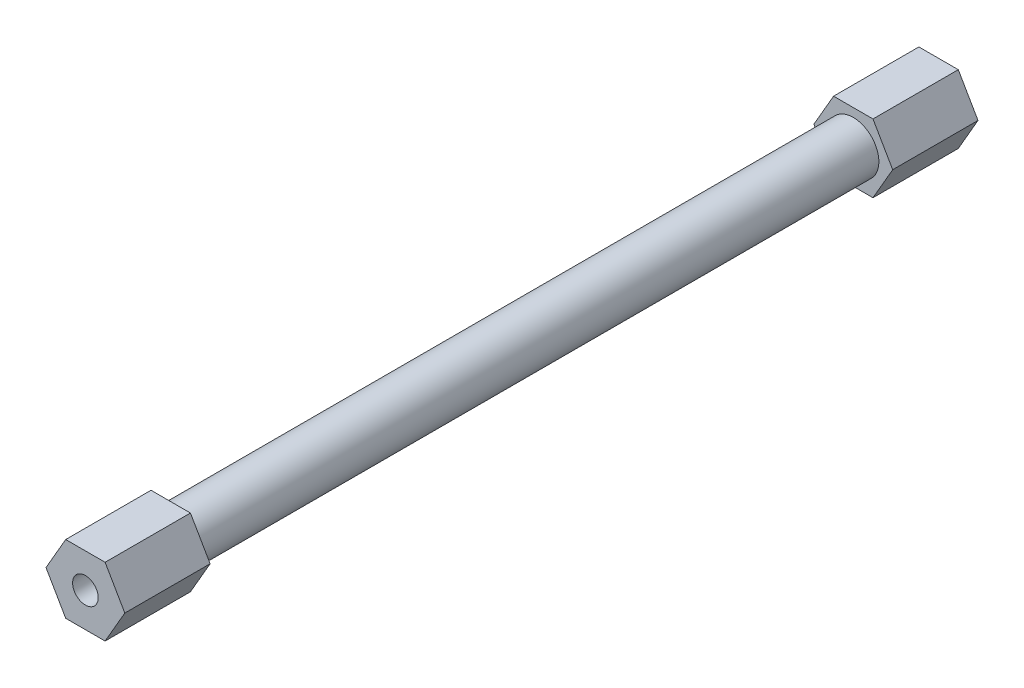
ISO-10303-21;
HEADER;
FILE_DESCRIPTION(('STEP AP214'),'2;1');
FILE_NAME('part.step','',(''),(''),'','','');
FILE_SCHEMA(('AUTOMOTIVE_DESIGN { 1 0 10303 214 1 1 1 1 }'));
ENDSEC;
DATA;
#1=APPLICATION_CONTEXT('core data for automotive mechanical design processes');
#2=APPLICATION_PROTOCOL_DEFINITION('international standard','automotive_design',2000,#1);
#3=PRODUCT_CONTEXT('',#1,'mechanical');
#4=PRODUCT('Part','Part','',(#3));
#5=PRODUCT_RELATED_PRODUCT_CATEGORY('part','',(#4));
#6=PRODUCT_DEFINITION_FORMATION('','',#4);
#7=PRODUCT_DEFINITION_CONTEXT('part definition',#1,'design');
#8=PRODUCT_DEFINITION('design','',#6,#7);
#9=PRODUCT_DEFINITION_SHAPE('','',#8);
#10=(LENGTH_UNIT() NAMED_UNIT(*) SI_UNIT(.MILLI.,.METRE.));
#11=(NAMED_UNIT(*) PLANE_ANGLE_UNIT() SI_UNIT($,.RADIAN.));
#12=(NAMED_UNIT(*) SI_UNIT($,.STERADIAN.) SOLID_ANGLE_UNIT());
#13=UNCERTAINTY_MEASURE_WITH_UNIT(LENGTH_MEASURE(1.E-05),#10,'distance_accuracy_value','');
#14=(GEOMETRIC_REPRESENTATION_CONTEXT(3) GLOBAL_UNCERTAINTY_ASSIGNED_CONTEXT((#13)) GLOBAL_UNIT_ASSIGNED_CONTEXT((#10,
#11,#12)) REPRESENTATION_CONTEXT('',''));
#15=CARTESIAN_POINT('',(0.,0.,0.));
#16=DIRECTION('',(0.,0.,1.));
#17=DIRECTION('',(1.,0.,0.));
#18=AXIS2_PLACEMENT_3D('',#15,#16,#17);
#19=CARTESIAN_POINT('',(0.,0.,100.));
#20=DIRECTION('',(0.,0.,-1.));
#21=DIRECTION('',(-1.,0.,0.));
#22=AXIS2_PLACEMENT_3D('',#19,#20,#21);
#23=CYLINDRICAL_SURFACE('',#22,3.);
#24=CARTESIAN_POINT('',(0.,0.,90.));
#25=DIRECTION('',(0.,0.,1.));
#26=DIRECTION('',(1.,0.,0.));
#27=AXIS2_PLACEMENT_3D('',#24,#25,#26);
#28=CIRCLE('',#27,3.);
#29=CARTESIAN_POINT('',(3.,0.,90.));
#30=VERTEX_POINT('',#29);
#31=EDGE_CURVE('E41',#30,#30,#28,.T.);
#32=ORIENTED_EDGE('',*,*,#31,.F.);
#33=EDGE_LOOP('',(#32));
#34=FACE_BOUND('',#33,.T.);
#35=CARTESIAN_POINT('',(0.,0.,9.99999999999999));
#36=DIRECTION('',(0.,0.,-1.));
#37=DIRECTION('',(-1.,0.,0.));
#38=AXIS2_PLACEMENT_3D('',#35,#36,#37);
#39=CIRCLE('',#38,3.);
#40=CARTESIAN_POINT('',(-3.,0.,9.99999999999999));
#41=VERTEX_POINT('',#40);
#42=EDGE_CURVE('E11',#41,#41,#39,.T.);
#43=ORIENTED_EDGE('',*,*,#42,.F.);
#44=EDGE_LOOP('',(#43));
#45=FACE_BOUND('',#44,.T.);
#46=ADVANCED_FACE('F32',(#34,#45),#23,.T.);
#47=CARTESIAN_POINT('',(0.,0.,100.));
#48=DIRECTION('',(0.,0.,1.));
#49=DIRECTION('',(1.,0.,0.));
#50=AXIS2_PLACEMENT_3D('',#47,#48,#49);
#51=PLANE('',#50);
#52=CARTESIAN_POINT('',(0.,0.,100.));
#53=DIRECTION('',(0.,0.,1.));
#54=DIRECTION('',(1.,0.,0.));
#55=AXIS2_PLACEMENT_3D('',#52,#53,#54);
#56=CIRCLE('',#55,1.5);
#57=CARTESIAN_POINT('',(1.5,0.,100.));
#58=VERTEX_POINT('',#57);
#59=EDGE_CURVE('E150',#58,#58,#56,.T.);
#60=ORIENTED_EDGE('',*,*,#59,.F.);
#61=EDGE_LOOP('',(#60));
#62=FACE_BOUND('',#61,.T.);
#63=DIRECTION('',(0.5,0.866025403784439,0.));
#64=VECTOR('',#63,1.);
#65=CARTESIAN_POINT('',(2.3094010767585,-4.,100.));
#66=LINE('',#65,#64);
#67=CARTESIAN_POINT('',(2.3094010767585,-4.,100.));
#68=VERTEX_POINT('',#67);
#69=CARTESIAN_POINT('',(4.61880215351701,0.,100.));
#70=VERTEX_POINT('',#69);
#71=EDGE_CURVE('E126',#68,#70,#66,.T.);
#72=ORIENTED_EDGE('',*,*,#71,.T.);
#73=DIRECTION('',(-0.5,0.866025403784438,0.));
#74=VECTOR('',#73,1.);
#75=CARTESIAN_POINT('',(4.61880215351701,0.,100.));
#76=LINE('',#75,#74);
#77=CARTESIAN_POINT('',(2.3094010767585,4.,100.));
#78=VERTEX_POINT('',#77);
#79=EDGE_CURVE('E129',#70,#78,#76,.T.);
#80=ORIENTED_EDGE('',*,*,#79,.T.);
#81=DIRECTION('',(-1.,0.,0.));
#82=VECTOR('',#81,1.);
#83=CARTESIAN_POINT('',(2.3094010767585,4.,100.));
#84=LINE('',#83,#82);
#85=CARTESIAN_POINT('',(-2.3094010767585,4.,100.));
#86=VERTEX_POINT('',#85);
#87=EDGE_CURVE('E133',#78,#86,#84,.T.);
#88=ORIENTED_EDGE('',*,*,#87,.T.);
#89=DIRECTION('',(-0.5,-0.866025403784439,0.));
#90=VECTOR('',#89,1.);
#91=CARTESIAN_POINT('',(-2.3094010767585,4.,100.));
#92=LINE('',#91,#90);
#93=CARTESIAN_POINT('',(-4.61880215351701,0.,100.));
#94=VERTEX_POINT('',#93);
#95=EDGE_CURVE('E136',#86,#94,#92,.T.);
#96=ORIENTED_EDGE('',*,*,#95,.T.);
#97=DIRECTION('',(0.5,-0.866025403784439,0.));
#98=VECTOR('',#97,1.);
#99=CARTESIAN_POINT('',(-4.61880215351701,0.,100.));
#100=LINE('',#99,#98);
#101=CARTESIAN_POINT('',(-2.3094010767585,-4.,100.));
#102=VERTEX_POINT('',#101);
#103=EDGE_CURVE('E102',#94,#102,#100,.T.);
#104=ORIENTED_EDGE('',*,*,#103,.T.);
#105=DIRECTION('',(1.,0.,0.));
#106=VECTOR('',#105,1.);
#107=CARTESIAN_POINT('',(-2.3094010767585,-4.,100.));
#108=LINE('',#107,#106);
#109=EDGE_CURVE('E139',#102,#68,#108,.T.);
#110=ORIENTED_EDGE('',*,*,#109,.T.);
#111=EDGE_LOOP('',(#72,#80,#88,#96,#104,#110));
#112=FACE_BOUND('',#111,.T.);
#113=ADVANCED_FACE('F169',(#62,#112),#51,.T.);
#114=CARTESIAN_POINT('',(0.,0.,0.));
#115=DIRECTION('',(0.,0.,1.));
#116=DIRECTION('',(1.,0.,0.));
#117=AXIS2_PLACEMENT_3D('',#114,#115,#116);
#118=PLANE('',#117);
#119=CARTESIAN_POINT('',(0.,0.,0.));
#120=DIRECTION('',(0.,0.,1.));
#121=DIRECTION('',(1.,0.,0.));
#122=AXIS2_PLACEMENT_3D('',#119,#120,#121);
#123=CIRCLE('',#122,1.5);
#124=CARTESIAN_POINT('',(1.5,0.,0.));
#125=VERTEX_POINT('',#124);
#126=EDGE_CURVE('E35',#125,#125,#123,.T.);
#127=ORIENTED_EDGE('',*,*,#126,.T.);
#128=EDGE_LOOP('',(#127));
#129=FACE_BOUND('',#128,.T.);
#130=DIRECTION('',(0.5,0.866025403784439,0.));
#131=VECTOR('',#130,1.);
#132=CARTESIAN_POINT('',(2.3094010767585,-4.,0.));
#133=LINE('',#132,#131);
#134=CARTESIAN_POINT('',(2.3094010767585,-4.,0.));
#135=VERTEX_POINT('',#134);
#136=CARTESIAN_POINT('',(4.61880215351701,0.,0.));
#137=VERTEX_POINT('',#136);
#138=EDGE_CURVE('E268',#135,#137,#133,.T.);
#139=ORIENTED_EDGE('',*,*,#138,.F.);
#140=DIRECTION('',(1.,0.,0.));
#141=VECTOR('',#140,1.);
#142=CARTESIAN_POINT('',(-2.3094010767585,-4.,0.));
#143=LINE('',#142,#141);
#144=CARTESIAN_POINT('',(-2.3094010767585,-4.,0.));
#145=VERTEX_POINT('',#144);
#146=EDGE_CURVE('E265',#145,#135,#143,.T.);
#147=ORIENTED_EDGE('',*,*,#146,.F.);
#148=DIRECTION('',(0.5,-0.866025403784439,0.));
#149=VECTOR('',#148,1.);
#150=CARTESIAN_POINT('',(-4.61880215351701,0.,0.));
#151=LINE('',#150,#149);
#152=CARTESIAN_POINT('',(-4.61880215351701,0.,0.));
#153=VERTEX_POINT('',#152);
#154=EDGE_CURVE('E262',#153,#145,#151,.T.);
#155=ORIENTED_EDGE('',*,*,#154,.F.);
#156=DIRECTION('',(-0.5,-0.866025403784439,0.));
#157=VECTOR('',#156,1.);
#158=CARTESIAN_POINT('',(-2.3094010767585,4.,0.));
#159=LINE('',#158,#157);
#160=CARTESIAN_POINT('',(-2.3094010767585,4.,0.));
#161=VERTEX_POINT('',#160);
#162=EDGE_CURVE('E259',#161,#153,#159,.T.);
#163=ORIENTED_EDGE('',*,*,#162,.F.);
#164=DIRECTION('',(-1.,0.,0.));
#165=VECTOR('',#164,1.);
#166=CARTESIAN_POINT('',(2.3094010767585,4.,0.));
#167=LINE('',#166,#165);
#168=CARTESIAN_POINT('',(2.3094010767585,4.,0.));
#169=VERTEX_POINT('',#168);
#170=EDGE_CURVE('E256',#169,#161,#167,.T.);
#171=ORIENTED_EDGE('',*,*,#170,.F.);
#172=DIRECTION('',(-0.5,0.866025403784438,0.));
#173=VECTOR('',#172,1.);
#174=CARTESIAN_POINT('',(4.61880215351701,0.,0.));
#175=LINE('',#174,#173);
#176=EDGE_CURVE('E252',#137,#169,#175,.T.);
#177=ORIENTED_EDGE('',*,*,#176,.F.);
#178=EDGE_LOOP('',(#139,#147,#155,#163,#171,#177));
#179=FACE_BOUND('',#178,.T.);
#180=ADVANCED_FACE('F157',(#129,#179),#118,.F.);
#181=CARTESIAN_POINT('',(0.,0.,100.));
#182=DIRECTION('',(0.,0.,-1.));
#183=DIRECTION('',(-1.,0.,0.));
#184=AXIS2_PLACEMENT_3D('',#181,#182,#183);
#185=CYLINDRICAL_SURFACE('',#184,1.5);
#186=ORIENTED_EDGE('',*,*,#126,.F.);
#187=EDGE_LOOP('',(#186));
#188=FACE_BOUND('',#187,.T.);
#189=ORIENTED_EDGE('',*,*,#59,.T.);
#190=EDGE_LOOP('',(#189));
#191=FACE_BOUND('',#190,.T.);
#192=ADVANCED_FACE('F160',(#188,#191),#185,.F.);
#193=CARTESIAN_POINT('',(0.,0.,90.));
#194=DIRECTION('',(0.,0.,1.));
#195=DIRECTION('',(1.,0.,0.));
#196=AXIS2_PLACEMENT_3D('',#193,#194,#195);
#197=PLANE('',#196);
#198=DIRECTION('',(0.5,0.866025403784439,0.));
#199=VECTOR('',#198,1.);
#200=CARTESIAN_POINT('',(2.3094010767585,-4.,90.));
#201=LINE('',#200,#199);
#202=CARTESIAN_POINT('',(2.3094010767585,-4.,90.));
#203=VERTEX_POINT('',#202);
#204=CARTESIAN_POINT('',(4.61880215351701,0.,90.));
#205=VERTEX_POINT('',#204);
#206=EDGE_CURVE('E142',#203,#205,#201,.T.);
#207=ORIENTED_EDGE('',*,*,#206,.F.);
#208=DIRECTION('',(1.,0.,0.));
#209=VECTOR('',#208,1.);
#210=CARTESIAN_POINT('',(-2.3094010767585,-4.,90.));
#211=LINE('',#210,#209);
#212=CARTESIAN_POINT('',(-2.3094010767585,-4.,90.));
#213=VERTEX_POINT('',#212);
#214=EDGE_CURVE('E116',#213,#203,#211,.T.);
#215=ORIENTED_EDGE('',*,*,#214,.F.);
#216=DIRECTION('',(0.5,-0.866025403784439,0.));
#217=VECTOR('',#216,1.);
#218=CARTESIAN_POINT('',(-4.61880215351701,0.,90.));
#219=LINE('',#218,#217);
#220=CARTESIAN_POINT('',(-4.61880215351701,0.,90.));
#221=VERTEX_POINT('',#220);
#222=EDGE_CURVE('E100',#221,#213,#219,.T.);
#223=ORIENTED_EDGE('',*,*,#222,.F.);
#224=DIRECTION('',(-0.5,-0.866025403784439,0.));
#225=VECTOR('',#224,1.);
#226=CARTESIAN_POINT('',(-2.3094010767585,4.,90.));
#227=LINE('',#226,#225);
#228=CARTESIAN_POINT('',(-2.3094010767585,4.,90.));
#229=VERTEX_POINT('',#228);
#230=EDGE_CURVE('E114',#229,#221,#227,.T.);
#231=ORIENTED_EDGE('',*,*,#230,.F.);
#232=DIRECTION('',(-1.,0.,0.));
#233=VECTOR('',#232,1.);
#234=CARTESIAN_POINT('',(2.3094010767585,4.,90.));
#235=LINE('',#234,#233);
#236=CARTESIAN_POINT('',(2.3094010767585,4.,90.));
#237=VERTEX_POINT('',#236);
#238=EDGE_CURVE('E119',#237,#229,#235,.T.);
#239=ORIENTED_EDGE('',*,*,#238,.F.);
#240=DIRECTION('',(-0.5,0.866025403784438,0.));
#241=VECTOR('',#240,1.);
#242=CARTESIAN_POINT('',(4.61880215351701,0.,90.));
#243=LINE('',#242,#241);
#244=EDGE_CURVE('E121',#205,#237,#243,.T.);
#245=ORIENTED_EDGE('',*,*,#244,.F.);
#246=EDGE_LOOP('',(#207,#215,#223,#231,#239,#245));
#247=FACE_BOUND('',#246,.T.);
#248=ORIENTED_EDGE('',*,*,#31,.T.);
#249=EDGE_LOOP('',(#248));
#250=FACE_BOUND('',#249,.T.);
#251=ADVANCED_FACE('F111',(#247,#250),#197,.F.);
#252=CARTESIAN_POINT('',(2.3094010767585,-4.,90.));
#253=DIRECTION('',(0.866025403784439,-0.5,0.));
#254=DIRECTION('',(0.5,0.866025403784439,0.));
#255=AXIS2_PLACEMENT_3D('',#252,#253,#254);
#256=PLANE('',#255);
#257=ORIENTED_EDGE('',*,*,#71,.F.);
#258=DIRECTION('',(0.,0.,1.));
#259=VECTOR('',#258,1.);
#260=CARTESIAN_POINT('',(2.3094010767585,-4.,90.));
#261=LINE('',#260,#259);
#262=EDGE_CURVE('E50',#203,#68,#261,.T.);
#263=ORIENTED_EDGE('',*,*,#262,.F.);
#264=ORIENTED_EDGE('',*,*,#206,.T.);
#265=DIRECTION('',(0.,0.,1.));
#266=VECTOR('',#265,1.);
#267=CARTESIAN_POINT('',(4.61880215351701,0.,90.));
#268=LINE('',#267,#266);
#269=EDGE_CURVE('E86',#205,#70,#268,.T.);
#270=ORIENTED_EDGE('',*,*,#269,.T.);
#271=EDGE_LOOP('',(#257,#263,#264,#270));
#272=FACE_BOUND('',#271,.T.);
#273=ADVANCED_FACE('F167',(#272),#256,.T.);
#274=CARTESIAN_POINT('',(-2.3094010767585,-4.,90.));
#275=DIRECTION('',(0.,-1.,0.));
#276=DIRECTION('',(0.,0.,-1.));
#277=AXIS2_PLACEMENT_3D('',#274,#275,#276);
#278=PLANE('',#277);
#279=ORIENTED_EDGE('',*,*,#109,.F.);
#280=DIRECTION('',(0.,0.,1.));
#281=VECTOR('',#280,1.);
#282=CARTESIAN_POINT('',(-2.3094010767585,-4.,90.));
#283=LINE('',#282,#281);
#284=EDGE_CURVE('E74',#213,#102,#283,.T.);
#285=ORIENTED_EDGE('',*,*,#284,.F.);
#286=ORIENTED_EDGE('',*,*,#214,.T.);
#287=ORIENTED_EDGE('',*,*,#262,.T.);
#288=EDGE_LOOP('',(#279,#285,#286,#287));
#289=FACE_BOUND('',#288,.T.);
#290=ADVANCED_FACE('F218',(#289),#278,.T.);
#291=CARTESIAN_POINT('',(-4.61880215351701,0.,90.));
#292=DIRECTION('',(-0.866025403784439,-0.5,0.));
#293=DIRECTION('',(0.5,-0.866025403784439,0.));
#294=AXIS2_PLACEMENT_3D('',#291,#292,#293);
#295=PLANE('',#294);
#296=ORIENTED_EDGE('',*,*,#103,.F.);
#297=DIRECTION('',(0.,0.,1.));
#298=VECTOR('',#297,1.);
#299=CARTESIAN_POINT('',(-4.61880215351701,0.,90.));
#300=LINE('',#299,#298);
#301=EDGE_CURVE('E97',#221,#94,#300,.T.);
#302=ORIENTED_EDGE('',*,*,#301,.F.);
#303=ORIENTED_EDGE('',*,*,#222,.T.);
#304=ORIENTED_EDGE('',*,*,#284,.T.);
#305=EDGE_LOOP('',(#296,#302,#303,#304));
#306=FACE_BOUND('',#305,.T.);
#307=ADVANCED_FACE('F99',(#306),#295,.T.);
#308=CARTESIAN_POINT('',(-2.3094010767585,4.,90.));
#309=DIRECTION('',(-0.866025403784439,0.5,0.));
#310=DIRECTION('',(-0.5,-0.866025403784439,0.));
#311=AXIS2_PLACEMENT_3D('',#308,#309,#310);
#312=PLANE('',#311);
#313=ORIENTED_EDGE('',*,*,#95,.F.);
#314=DIRECTION('',(0.,0.,1.));
#315=VECTOR('',#314,1.);
#316=CARTESIAN_POINT('',(-2.3094010767585,4.,90.));
#317=LINE('',#316,#315);
#318=EDGE_CURVE('E107',#229,#86,#317,.T.);
#319=ORIENTED_EDGE('',*,*,#318,.F.);
#320=ORIENTED_EDGE('',*,*,#230,.T.);
#321=ORIENTED_EDGE('',*,*,#301,.T.);
#322=EDGE_LOOP('',(#313,#319,#320,#321));
#323=FACE_BOUND('',#322,.T.);
#324=ADVANCED_FACE('F118',(#323),#312,.T.);
#325=CARTESIAN_POINT('',(2.3094010767585,4.,90.));
#326=DIRECTION('',(0.,1.,0.));
#327=DIRECTION('',(-1.,0.,0.));
#328=AXIS2_PLACEMENT_3D('',#325,#326,#327);
#329=PLANE('',#328);
#330=ORIENTED_EDGE('',*,*,#87,.F.);
#331=DIRECTION('',(0.,0.,1.));
#332=VECTOR('',#331,1.);
#333=CARTESIAN_POINT('',(2.3094010767585,4.,90.));
#334=LINE('',#333,#332);
#335=EDGE_CURVE('E146',#237,#78,#334,.T.);
#336=ORIENTED_EDGE('',*,*,#335,.F.);
#337=ORIENTED_EDGE('',*,*,#238,.T.);
#338=ORIENTED_EDGE('',*,*,#318,.T.);
#339=EDGE_LOOP('',(#330,#336,#337,#338));
#340=FACE_BOUND('',#339,.T.);
#341=ADVANCED_FACE('F195',(#340),#329,.T.);
#342=CARTESIAN_POINT('',(4.61880215351701,0.,90.));
#343=DIRECTION('',(0.866025403784438,0.5,0.));
#344=DIRECTION('',(-0.5,0.866025403784438,0.));
#345=AXIS2_PLACEMENT_3D('',#342,#343,#344);
#346=PLANE('',#345);
#347=ORIENTED_EDGE('',*,*,#79,.F.);
#348=ORIENTED_EDGE('',*,*,#269,.F.);
#349=ORIENTED_EDGE('',*,*,#244,.T.);
#350=ORIENTED_EDGE('',*,*,#335,.T.);
#351=EDGE_LOOP('',(#347,#348,#349,#350));
#352=FACE_BOUND('',#351,.T.);
#353=ADVANCED_FACE('F185',(#352),#346,.T.);
#354=CARTESIAN_POINT('',(0.,0.,10.));
#355=DIRECTION('',(0.,0.,-1.));
#356=DIRECTION('',(1.,0.,0.));
#357=AXIS2_PLACEMENT_3D('',#354,#355,#356);
#358=PLANE('',#357);
#359=DIRECTION('',(0.5,0.866025403784439,0.));
#360=VECTOR('',#359,1.);
#361=CARTESIAN_POINT('',(2.3094010767585,-4.,10.));
#362=LINE('',#361,#360);
#363=CARTESIAN_POINT('',(2.3094010767585,-4.,10.));
#364=VERTEX_POINT('',#363);
#365=CARTESIAN_POINT('',(4.61880215351701,0.,10.));
#366=VERTEX_POINT('',#365);
#367=EDGE_CURVE('E255',#364,#366,#362,.T.);
#368=ORIENTED_EDGE('',*,*,#367,.T.);
#369=DIRECTION('',(-0.5,0.866025403784438,0.));
#370=VECTOR('',#369,1.);
#371=CARTESIAN_POINT('',(4.61880215351701,0.,10.));
#372=LINE('',#371,#370);
#373=CARTESIAN_POINT('',(2.3094010767585,4.,10.));
#374=VERTEX_POINT('',#373);
#375=EDGE_CURVE('E238',#366,#374,#372,.T.);
#376=ORIENTED_EDGE('',*,*,#375,.T.);
#377=DIRECTION('',(-1.,0.,0.));
#378=VECTOR('',#377,1.);
#379=CARTESIAN_POINT('',(2.3094010767585,4.,10.));
#380=LINE('',#379,#378);
#381=CARTESIAN_POINT('',(-2.3094010767585,4.,10.));
#382=VERTEX_POINT('',#381);
#383=EDGE_CURVE('E273',#374,#382,#380,.T.);
#384=ORIENTED_EDGE('',*,*,#383,.T.);
#385=DIRECTION('',(-0.5,-0.866025403784439,0.));
#386=VECTOR('',#385,1.);
#387=CARTESIAN_POINT('',(-2.3094010767585,4.,10.));
#388=LINE('',#387,#386);
#389=CARTESIAN_POINT('',(-4.61880215351701,0.,10.));
#390=VERTEX_POINT('',#389);
#391=EDGE_CURVE('E276',#382,#390,#388,.T.);
#392=ORIENTED_EDGE('',*,*,#391,.T.);
#393=DIRECTION('',(0.5,-0.866025403784439,0.));
#394=VECTOR('',#393,1.);
#395=CARTESIAN_POINT('',(-4.61880215351701,0.,10.));
#396=LINE('',#395,#394);
#397=CARTESIAN_POINT('',(-2.3094010767585,-4.,10.));
#398=VERTEX_POINT('',#397);
#399=EDGE_CURVE('E279',#390,#398,#396,.T.);
#400=ORIENTED_EDGE('',*,*,#399,.T.);
#401=DIRECTION('',(1.,0.,0.));
#402=VECTOR('',#401,1.);
#403=CARTESIAN_POINT('',(-2.3094010767585,-4.,10.));
#404=LINE('',#403,#402);
#405=EDGE_CURVE('E282',#398,#364,#404,.T.);
#406=ORIENTED_EDGE('',*,*,#405,.T.);
#407=EDGE_LOOP('',(#368,#376,#384,#392,#400,#406));
#408=FACE_BOUND('',#407,.T.);
#409=ORIENTED_EDGE('',*,*,#42,.T.);
#410=EDGE_LOOP('',(#409));
#411=FACE_BOUND('',#410,.T.);
#412=ADVANCED_FACE('F182',(#408,#411),#358,.F.);
#413=CARTESIAN_POINT('',(2.3094010767585,-4.,10.));
#414=DIRECTION('',(-0.866025403784439,0.5,0.));
#415=DIRECTION('',(-0.5,-0.866025403784439,0.));
#416=AXIS2_PLACEMENT_3D('',#413,#414,#415);
#417=PLANE('',#416);
#418=ORIENTED_EDGE('',*,*,#138,.T.);
#419=DIRECTION('',(0.,0.,-1.));
#420=VECTOR('',#419,1.);
#421=CARTESIAN_POINT('',(4.61880215351701,0.,10.));
#422=LINE('',#421,#420);
#423=EDGE_CURVE('E130',#366,#137,#422,.T.);
#424=ORIENTED_EDGE('',*,*,#423,.F.);
#425=ORIENTED_EDGE('',*,*,#367,.F.);
#426=DIRECTION('',(0.,0.,-1.));
#427=VECTOR('',#426,1.);
#428=CARTESIAN_POINT('',(2.3094010767585,-4.,10.));
#429=LINE('',#428,#427);
#430=EDGE_CURVE('E234',#364,#135,#429,.T.);
#431=ORIENTED_EDGE('',*,*,#430,.T.);
#432=EDGE_LOOP('',(#418,#424,#425,#431));
#433=FACE_BOUND('',#432,.T.);
#434=ADVANCED_FACE('F184',(#433),#417,.F.);
#435=CARTESIAN_POINT('',(4.61880215351701,0.,10.));
#436=DIRECTION('',(-0.866025403784438,-0.5,0.));
#437=DIRECTION('',(0.5,-0.866025403784438,0.));
#438=AXIS2_PLACEMENT_3D('',#435,#436,#437);
#439=PLANE('',#438);
#440=ORIENTED_EDGE('',*,*,#176,.T.);
#441=DIRECTION('',(0.,0.,-1.));
#442=VECTOR('',#441,1.);
#443=CARTESIAN_POINT('',(2.3094010767585,4.,10.));
#444=LINE('',#443,#442);
#445=EDGE_CURVE('E247',#374,#169,#444,.T.);
#446=ORIENTED_EDGE('',*,*,#445,.F.);
#447=ORIENTED_EDGE('',*,*,#375,.F.);
#448=ORIENTED_EDGE('',*,*,#423,.T.);
#449=EDGE_LOOP('',(#440,#446,#447,#448));
#450=FACE_BOUND('',#449,.T.);
#451=ADVANCED_FACE('F192',(#450),#439,.F.);
#452=CARTESIAN_POINT('',(2.3094010767585,4.,10.));
#453=DIRECTION('',(0.,-1.,0.));
#454=DIRECTION('',(1.,0.,0.));
#455=AXIS2_PLACEMENT_3D('',#452,#453,#454);
#456=PLANE('',#455);
#457=ORIENTED_EDGE('',*,*,#170,.T.);
#458=DIRECTION('',(0.,0.,-1.));
#459=VECTOR('',#458,1.);
#460=CARTESIAN_POINT('',(-2.3094010767585,4.,10.));
#461=LINE('',#460,#459);
#462=EDGE_CURVE('E244',#382,#161,#461,.T.);
#463=ORIENTED_EDGE('',*,*,#462,.F.);
#464=ORIENTED_EDGE('',*,*,#383,.F.);
#465=ORIENTED_EDGE('',*,*,#445,.T.);
#466=EDGE_LOOP('',(#457,#463,#464,#465));
#467=FACE_BOUND('',#466,.T.);
#468=ADVANCED_FACE('F201',(#467),#456,.F.);
#469=CARTESIAN_POINT('',(-2.3094010767585,4.,10.));
#470=DIRECTION('',(0.866025403784439,-0.5,0.));
#471=DIRECTION('',(0.5,0.866025403784439,0.));
#472=AXIS2_PLACEMENT_3D('',#469,#470,#471);
#473=PLANE('',#472);
#474=ORIENTED_EDGE('',*,*,#162,.T.);
#475=DIRECTION('',(0.,0.,-1.));
#476=VECTOR('',#475,1.);
#477=CARTESIAN_POINT('',(-4.61880215351701,0.,10.));
#478=LINE('',#477,#476);
#479=EDGE_CURVE('E241',#390,#153,#478,.T.);
#480=ORIENTED_EDGE('',*,*,#479,.F.);
#481=ORIENTED_EDGE('',*,*,#391,.F.);
#482=ORIENTED_EDGE('',*,*,#462,.T.);
#483=EDGE_LOOP('',(#474,#480,#481,#482));
#484=FACE_BOUND('',#483,.T.);
#485=ADVANCED_FACE('F205',(#484),#473,.F.);
#486=CARTESIAN_POINT('',(-4.61880215351701,0.,10.));
#487=DIRECTION('',(0.866025403784439,0.5,0.));
#488=DIRECTION('',(-0.5,0.866025403784439,0.));
#489=AXIS2_PLACEMENT_3D('',#486,#487,#488);
#490=PLANE('',#489);
#491=ORIENTED_EDGE('',*,*,#154,.T.);
#492=DIRECTION('',(0.,0.,-1.));
#493=VECTOR('',#492,1.);
#494=CARTESIAN_POINT('',(-2.3094010767585,-4.,10.));
#495=LINE('',#494,#493);
#496=EDGE_CURVE('E237',#398,#145,#495,.T.);
#497=ORIENTED_EDGE('',*,*,#496,.F.);
#498=ORIENTED_EDGE('',*,*,#399,.F.);
#499=ORIENTED_EDGE('',*,*,#479,.T.);
#500=EDGE_LOOP('',(#491,#497,#498,#499));
#501=FACE_BOUND('',#500,.T.);
#502=ADVANCED_FACE('F209',(#501),#490,.F.);
#503=CARTESIAN_POINT('',(-2.3094010767585,-4.,10.));
#504=DIRECTION('',(0.,1.,0.));
#505=DIRECTION('',(0.,0.,1.));
#506=AXIS2_PLACEMENT_3D('',#503,#504,#505);
#507=PLANE('',#506);
#508=ORIENTED_EDGE('',*,*,#146,.T.);
#509=ORIENTED_EDGE('',*,*,#430,.F.);
#510=ORIENTED_EDGE('',*,*,#405,.F.);
#511=ORIENTED_EDGE('',*,*,#496,.T.);
#512=EDGE_LOOP('',(#508,#509,#510,#511));
#513=FACE_BOUND('',#512,.T.);
#514=ADVANCED_FACE('F213',(#513),#507,.F.);
#515=CLOSED_SHELL('',(#46,#113,#180,#192,#251,#273,#290,#307,#324,#341,#353,#412,#434,#451,#468,
#485,#502,#514));
#516=MANIFOLD_SOLID_BREP('B2',#515);
#517=ADVANCED_BREP_SHAPE_REPRESENTATION('',(#18,#516),#14);
#518=SHAPE_DEFINITION_REPRESENTATION(#9,#517);
ENDSEC;
END-ISO-10303-21;
